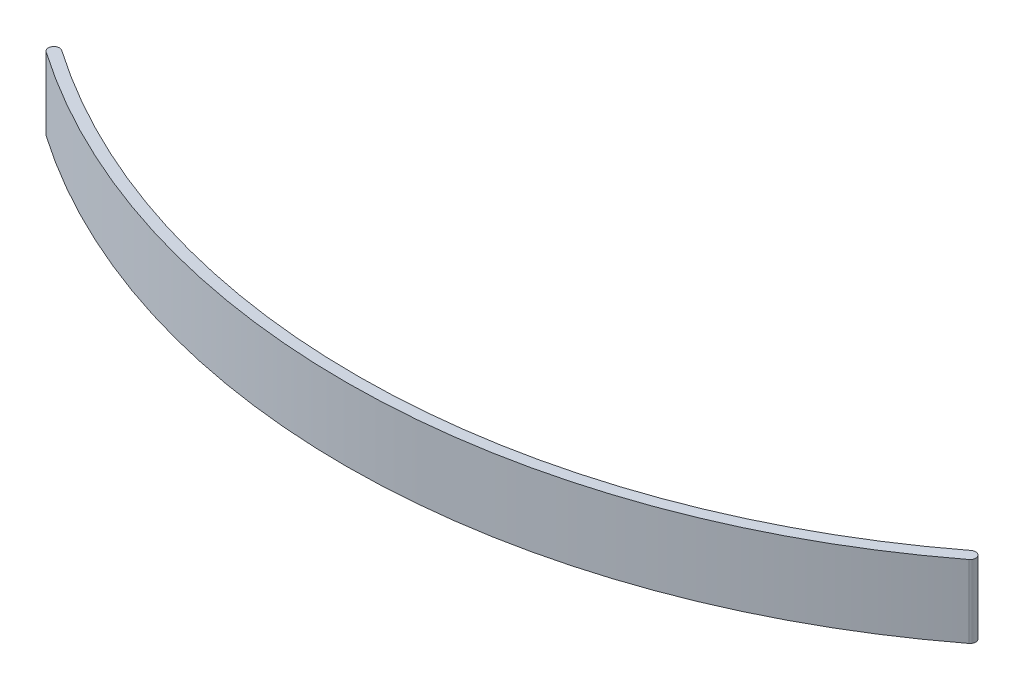
ISO-10303-21;
HEADER;
FILE_DESCRIPTION(('STEP AP214'),'2;1');
FILE_NAME('part.step','',(''),(''),'','','');
FILE_SCHEMA(('AUTOMOTIVE_DESIGN { 1 0 10303 214 1 1 1 1 }'));
ENDSEC;
DATA;
#1=APPLICATION_CONTEXT('core data for automotive mechanical design processes');
#2=APPLICATION_PROTOCOL_DEFINITION('international standard','automotive_design',2000,#1);
#3=PRODUCT_CONTEXT('',#1,'mechanical');
#4=PRODUCT('Part','Part','',(#3));
#5=PRODUCT_RELATED_PRODUCT_CATEGORY('part','',(#4));
#6=PRODUCT_DEFINITION_FORMATION('','',#4);
#7=PRODUCT_DEFINITION_CONTEXT('part definition',#1,'design');
#8=PRODUCT_DEFINITION('design','',#6,#7);
#9=PRODUCT_DEFINITION_SHAPE('','',#8);
#10=(LENGTH_UNIT() NAMED_UNIT(*) SI_UNIT(.MILLI.,.METRE.));
#11=(NAMED_UNIT(*) PLANE_ANGLE_UNIT() SI_UNIT($,.RADIAN.));
#12=(NAMED_UNIT(*) SI_UNIT($,.STERADIAN.) SOLID_ANGLE_UNIT());
#13=UNCERTAINTY_MEASURE_WITH_UNIT(LENGTH_MEASURE(1.E-05),#10,'distance_accuracy_value','');
#14=(GEOMETRIC_REPRESENTATION_CONTEXT(3) GLOBAL_UNCERTAINTY_ASSIGNED_CONTEXT((#13)) GLOBAL_UNIT_ASSIGNED_CONTEXT((#10,
#11,#12)) REPRESENTATION_CONTEXT('',''));
#15=CARTESIAN_POINT('',(0.,0.,0.));
#16=DIRECTION('',(0.,0.,1.));
#17=DIRECTION('',(1.,0.,0.));
#18=AXIS2_PLACEMENT_3D('',#15,#16,#17);
#19=CARTESIAN_POINT('',(-1.64551119080214,6.5,-67.8734692709566));
#20=DIRECTION('',(0.,-1.,0.));
#21=DIRECTION('',(0.,0.,-1.));
#22=AXIS2_PLACEMENT_3D('',#19,#20,#21);
#23=CYLINDRICAL_SURFACE('',#22,68.3934130675025);
#24=CARTESIAN_POINT('',(-1.64551119080214,0.,-67.8734692709566));
#25=DIRECTION('',(0.,1.,0.));
#26=DIRECTION('',(0.,0.,1.));
#27=AXIS2_PLACEMENT_3D('',#24,#25,#26);
#28=CIRCLE('',#27,68.3934130675025);
#29=CARTESIAN_POINT('',(-40.5888606608806,0.,-11.6500356949702));
#30=VERTEX_POINT('',#29);
#31=CARTESIAN_POINT('',(39.9766249212834,0.,-13.60324966122));
#32=VERTEX_POINT('',#31);
#33=EDGE_CURVE('E101',#30,#32,#28,.T.);
#34=ORIENTED_EDGE('',*,*,#33,.T.);
#35=DIRECTION('',(0.,-1.,0.));
#36=VECTOR('',#35,1.);
#37=CARTESIAN_POINT('',(39.9766249212834,6.5,-13.60324966122));
#38=LINE('',#37,#36);
#39=CARTESIAN_POINT('',(39.9766249212834,6.5,-13.60324966122));
#40=VERTEX_POINT('',#39);
#41=EDGE_CURVE('E11',#40,#32,#38,.T.);
#42=ORIENTED_EDGE('',*,*,#41,.F.);
#43=CARTESIAN_POINT('',(-1.64551119080214,6.5,-67.8734692709566));
#44=DIRECTION('',(0.,1.,0.));
#45=DIRECTION('',(0.,0.,1.));
#46=AXIS2_PLACEMENT_3D('',#43,#44,#45);
#47=CIRCLE('',#46,68.3934130675025);
#48=CARTESIAN_POINT('',(-40.5888606608806,6.5,-11.6500356949702));
#49=VERTEX_POINT('',#48);
#50=EDGE_CURVE('E86',#49,#40,#47,.T.);
#51=ORIENTED_EDGE('',*,*,#50,.F.);
#52=DIRECTION('',(0.,-1.,0.));
#53=VECTOR('',#52,1.);
#54=CARTESIAN_POINT('',(-40.5888606608806,6.5,-11.6500356949702));
#55=LINE('',#54,#53);
#56=EDGE_CURVE('E97',#49,#30,#55,.T.);
#57=ORIENTED_EDGE('',*,*,#56,.T.);
#58=EDGE_LOOP('',(#34,#42,#51,#57));
#59=FACE_BOUND('',#58,.T.);
#60=ADVANCED_FACE('F39',(#59),#23,.T.);
#61=CARTESIAN_POINT('',(39.6723402376766,6.5,-14.));
#62=DIRECTION('',(0.,-1.,0.));
#63=DIRECTION('',(0.,0.,-1.));
#64=AXIS2_PLACEMENT_3D('',#61,#62,#63);
#65=CYLINDRICAL_SURFACE('',#64,0.500000000000004);
#66=CARTESIAN_POINT('',(39.6723402376766,0.,-14.));
#67=DIRECTION('',(0.,1.,0.));
#68=DIRECTION('',(0.,0.,1.));
#69=AXIS2_PLACEMENT_3D('',#66,#67,#68);
#70=CIRCLE('',#69,0.500000000000004);
#71=CARTESIAN_POINT('',(39.3680555540695,0.,-14.3967503387804));
#72=VERTEX_POINT('',#71);
#73=EDGE_CURVE('E91',#32,#72,#70,.T.);
#74=ORIENTED_EDGE('',*,*,#73,.T.);
#75=DIRECTION('',(0.,-1.,0.));
#76=VECTOR('',#75,1.);
#77=CARTESIAN_POINT('',(39.3680555540695,6.5,-14.3967503387804));
#78=LINE('',#77,#76);
#79=CARTESIAN_POINT('',(39.3680555540695,6.5,-14.3967503387804));
#80=VERTEX_POINT('',#79);
#81=EDGE_CURVE('E47',#80,#72,#78,.T.);
#82=ORIENTED_EDGE('',*,*,#81,.F.);
#83=CARTESIAN_POINT('',(39.6723402376766,6.5,-14.));
#84=DIRECTION('',(0.,1.,0.));
#85=DIRECTION('',(0.,0.,1.));
#86=AXIS2_PLACEMENT_3D('',#83,#84,#85);
#87=CIRCLE('',#86,0.500000000000004);
#88=EDGE_CURVE('E81',#40,#80,#87,.T.);
#89=ORIENTED_EDGE('',*,*,#88,.F.);
#90=ORIENTED_EDGE('',*,*,#41,.T.);
#91=EDGE_LOOP('',(#74,#82,#89,#90));
#92=FACE_BOUND('',#91,.T.);
#93=ADVANCED_FACE('F90',(#92),#65,.T.);
#94=CARTESIAN_POINT('',(-1.64551119080214,6.5,-67.8734692709566));
#95=DIRECTION('',(0.,-1.,0.));
#96=DIRECTION('',(0.,0.,-1.));
#97=AXIS2_PLACEMENT_3D('',#94,#95,#96);
#98=CYLINDRICAL_SURFACE('',#97,67.3934130675025);
#99=CARTESIAN_POINT('',(-1.64551119080214,0.,-67.8734692709566));
#100=DIRECTION('',(0.,1.,0.));
#101=DIRECTION('',(0.,0.,1.));
#102=AXIS2_PLACEMENT_3D('',#99,#100,#101);
#103=CIRCLE('',#102,67.3934130675025);
#104=CARTESIAN_POINT('',(-40.0194586128845,0.,-12.4720948824609));
#105=VERTEX_POINT('',#104);
#106=EDGE_CURVE('E105',#105,#72,#103,.T.);
#107=ORIENTED_EDGE('',*,*,#106,.F.);
#108=DIRECTION('',(0.,-1.,0.));
#109=VECTOR('',#108,1.);
#110=CARTESIAN_POINT('',(-40.0194586128845,6.5,-12.4720948824609));
#111=LINE('',#110,#109);
#112=CARTESIAN_POINT('',(-40.0194586128845,6.5,-12.4720948824609));
#113=VERTEX_POINT('',#112);
#114=EDGE_CURVE('E71',#113,#105,#111,.T.);
#115=ORIENTED_EDGE('',*,*,#114,.F.);
#116=CARTESIAN_POINT('',(-1.64551119080214,6.5,-67.8734692709566));
#117=DIRECTION('',(0.,1.,0.));
#118=DIRECTION('',(0.,0.,1.));
#119=AXIS2_PLACEMENT_3D('',#116,#117,#118);
#120=CIRCLE('',#119,67.3934130675025);
#121=EDGE_CURVE('E84',#113,#80,#120,.T.);
#122=ORIENTED_EDGE('',*,*,#121,.T.);
#123=ORIENTED_EDGE('',*,*,#81,.T.);
#124=EDGE_LOOP('',(#107,#115,#122,#123));
#125=FACE_BOUND('',#124,.T.);
#126=ADVANCED_FACE('F95',(#125),#98,.F.);
#127=CARTESIAN_POINT('',(-40.3041596368826,6.5,-12.0610652887153));
#128=DIRECTION('',(0.,-1.,0.));
#129=DIRECTION('',(0.,0.,-1.));
#130=AXIS2_PLACEMENT_3D('',#127,#128,#129);
#131=CYLINDRICAL_SURFACE('',#130,0.500000000000002);
#132=CARTESIAN_POINT('',(-40.3041596368826,0.,-12.0610652887153));
#133=DIRECTION('',(0.,1.,0.));
#134=DIRECTION('',(0.,0.,1.));
#135=AXIS2_PLACEMENT_3D('',#132,#133,#134);
#136=CIRCLE('',#135,0.500000000000002);
#137=EDGE_CURVE('E74',#105,#30,#136,.T.);
#138=ORIENTED_EDGE('',*,*,#137,.T.);
#139=ORIENTED_EDGE('',*,*,#56,.F.);
#140=CARTESIAN_POINT('',(-40.3041596368826,6.5,-12.0610652887153));
#141=DIRECTION('',(0.,1.,0.));
#142=DIRECTION('',(0.,0.,1.));
#143=AXIS2_PLACEMENT_3D('',#140,#141,#142);
#144=CIRCLE('',#143,0.500000000000002);
#145=EDGE_CURVE('E55',#113,#49,#144,.T.);
#146=ORIENTED_EDGE('',*,*,#145,.F.);
#147=ORIENTED_EDGE('',*,*,#114,.T.);
#148=EDGE_LOOP('',(#138,#139,#146,#147));
#149=FACE_BOUND('',#148,.T.);
#150=ADVANCED_FACE('F118',(#149),#131,.T.);
#151=CARTESIAN_POINT('',(0.,6.5,0.));
#152=DIRECTION('',(0.,1.,0.));
#153=DIRECTION('',(0.,0.,1.));
#154=AXIS2_PLACEMENT_3D('',#151,#152,#153);
#155=PLANE('',#154);
#156=ORIENTED_EDGE('',*,*,#50,.T.);
#157=ORIENTED_EDGE('',*,*,#88,.T.);
#158=ORIENTED_EDGE('',*,*,#121,.F.);
#159=ORIENTED_EDGE('',*,*,#145,.T.);
#160=EDGE_LOOP('',(#156,#157,#158,#159));
#161=FACE_BOUND('',#160,.T.);
#162=ADVANCED_FACE('F82',(#161),#155,.T.);
#163=CARTESIAN_POINT('',(0.,0.,0.));
#164=DIRECTION('',(0.,1.,0.));
#165=DIRECTION('',(0.,0.,1.));
#166=AXIS2_PLACEMENT_3D('',#163,#164,#165);
#167=PLANE('',#166);
#168=ORIENTED_EDGE('',*,*,#33,.F.);
#169=ORIENTED_EDGE('',*,*,#137,.F.);
#170=ORIENTED_EDGE('',*,*,#106,.T.);
#171=ORIENTED_EDGE('',*,*,#73,.F.);
#172=EDGE_LOOP('',(#168,#169,#170,#171));
#173=FACE_BOUND('',#172,.T.);
#174=ADVANCED_FACE('F112',(#173),#167,.F.);
#175=CLOSED_SHELL('',(#60,#93,#126,#150,#162,#174));
#176=MANIFOLD_SOLID_BREP('B2',#175);
#177=ADVANCED_BREP_SHAPE_REPRESENTATION('',(#18,#176),#14);
#178=SHAPE_DEFINITION_REPRESENTATION(#9,#177);
ENDSEC;
END-ISO-10303-21;
